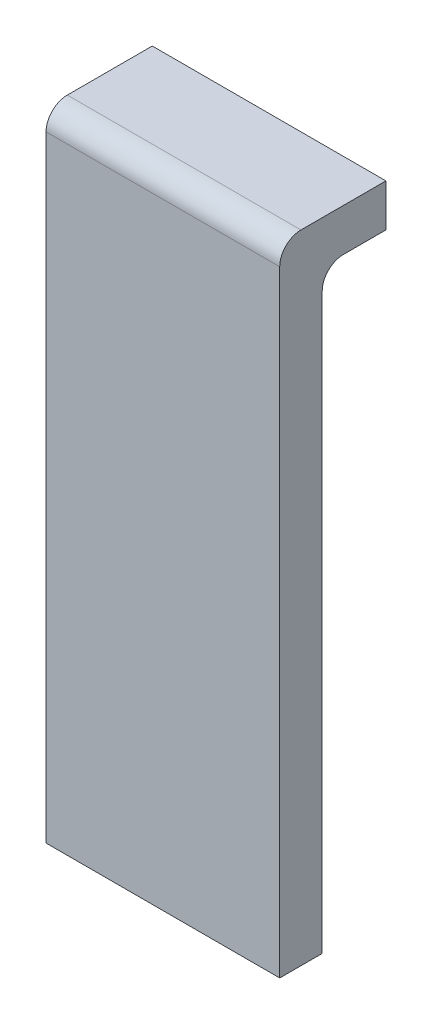
ISO-10303-21;
HEADER;
FILE_DESCRIPTION(('STEP AP214'),'2;1');
FILE_NAME('part.step','',(''),(''),'','','');
FILE_SCHEMA(('AUTOMOTIVE_DESIGN { 1 0 10303 214 1 1 1 1 }'));
ENDSEC;
DATA;
#1=APPLICATION_CONTEXT('core data for automotive mechanical design processes');
#2=APPLICATION_PROTOCOL_DEFINITION('international standard','automotive_design',2000,#1);
#3=PRODUCT_CONTEXT('',#1,'mechanical');
#4=PRODUCT('Part','Part','',(#3));
#5=PRODUCT_RELATED_PRODUCT_CATEGORY('part','',(#4));
#6=PRODUCT_DEFINITION_FORMATION('','',#4);
#7=PRODUCT_DEFINITION_CONTEXT('part definition',#1,'design');
#8=PRODUCT_DEFINITION('design','',#6,#7);
#9=PRODUCT_DEFINITION_SHAPE('','',#8);
#10=(LENGTH_UNIT() NAMED_UNIT(*) SI_UNIT(.MILLI.,.METRE.));
#11=(NAMED_UNIT(*) PLANE_ANGLE_UNIT() SI_UNIT($,.RADIAN.));
#12=(NAMED_UNIT(*) SI_UNIT($,.STERADIAN.) SOLID_ANGLE_UNIT());
#13=UNCERTAINTY_MEASURE_WITH_UNIT(LENGTH_MEASURE(1.E-05),#10,'distance_accuracy_value','');
#14=(GEOMETRIC_REPRESENTATION_CONTEXT(3) GLOBAL_UNCERTAINTY_ASSIGNED_CONTEXT((#13)) GLOBAL_UNIT_ASSIGNED_CONTEXT((#10,
#11,#12)) REPRESENTATION_CONTEXT('',''));
#15=CARTESIAN_POINT('',(0.,0.,0.));
#16=DIRECTION('',(0.,0.,1.));
#17=DIRECTION('',(1.,0.,0.));
#18=AXIS2_PLACEMENT_3D('',#15,#16,#17);
#19=CARTESIAN_POINT('',(0.,0.,-0.2));
#20=DIRECTION('',(-1.,0.,0.));
#21=DIRECTION('',(0.,0.,1.));
#22=AXIS2_PLACEMENT_3D('',#19,#20,#21);
#23=PLANE('',#22);
#24=DIRECTION('',(0.,-1.,0.));
#25=VECTOR('',#24,1.);
#26=CARTESIAN_POINT('',(0.,0.,0.));
#27=LINE('',#26,#25);
#28=CARTESIAN_POINT('',(0.,2.9,0.));
#29=VERTEX_POINT('',#28);
#30=CARTESIAN_POINT('',(0.,0.,0.));
#31=VERTEX_POINT('',#30);
#32=EDGE_CURVE('E119',#29,#31,#27,.T.);
#33=ORIENTED_EDGE('',*,*,#32,.F.);
#34=CARTESIAN_POINT('',(0.,2.9,-0.1));
#35=DIRECTION('',(-1.,0.,0.));
#36=DIRECTION('',(0.,0.,1.));
#37=AXIS2_PLACEMENT_3D('',#34,#35,#36);
#38=CIRCLE('',#37,0.1);
#39=CARTESIAN_POINT('',(0.,3.,-0.1));
#40=VERTEX_POINT('',#39);
#41=EDGE_CURVE('E132',#29,#40,#38,.T.);
#42=ORIENTED_EDGE('',*,*,#41,.T.);
#43=DIRECTION('',(0.,0.,1.));
#44=VECTOR('',#43,1.);
#45=CARTESIAN_POINT('',(0.,3.,-0.2));
#46=LINE('',#45,#44);
#47=CARTESIAN_POINT('',(0.,3.,-0.5));
#48=VERTEX_POINT('',#47);
#49=EDGE_CURVE('E133',#48,#40,#46,.T.);
#50=ORIENTED_EDGE('',*,*,#49,.F.);
#51=DIRECTION('',(0.,1.,0.));
#52=VECTOR('',#51,1.);
#53=CARTESIAN_POINT('',(0.,3.,-0.5));
#54=LINE('',#53,#52);
#55=CARTESIAN_POINT('',(0.,2.8,-0.5));
#56=VERTEX_POINT('',#55);
#57=EDGE_CURVE('E108',#56,#48,#54,.T.);
#58=ORIENTED_EDGE('',*,*,#57,.F.);
#59=DIRECTION('',(0.,0.,1.));
#60=VECTOR('',#59,1.);
#61=CARTESIAN_POINT('',(0.,2.8,-0.5));
#62=LINE('',#61,#60);
#63=CARTESIAN_POINT('',(0.,2.8,-0.3));
#64=VERTEX_POINT('',#63);
#65=EDGE_CURVE('E104',#56,#64,#62,.T.);
#66=ORIENTED_EDGE('',*,*,#65,.T.);
#67=CARTESIAN_POINT('',(0.,2.7,-0.3));
#68=DIRECTION('',(-1.,0.,0.));
#69=DIRECTION('',(0.,0.,1.));
#70=AXIS2_PLACEMENT_3D('',#67,#68,#69);
#71=CIRCLE('',#70,0.1);
#72=CARTESIAN_POINT('',(0.,2.7,-0.2));
#73=VERTEX_POINT('',#72);
#74=EDGE_CURVE('E40',#64,#73,#71,.F.);
#75=ORIENTED_EDGE('',*,*,#74,.T.);
#76=DIRECTION('',(0.,-1.,0.));
#77=VECTOR('',#76,1.);
#78=CARTESIAN_POINT('',(0.,0.,-0.2));
#79=LINE('',#78,#77);
#80=CARTESIAN_POINT('',(0.,0.,-0.2));
#81=VERTEX_POINT('',#80);
#82=EDGE_CURVE('E134',#73,#81,#79,.T.);
#83=ORIENTED_EDGE('',*,*,#82,.T.);
#84=DIRECTION('',(0.,0.,1.));
#85=VECTOR('',#84,1.);
#86=CARTESIAN_POINT('',(0.,0.,-0.2));
#87=LINE('',#86,#85);
#88=EDGE_CURVE('E151',#81,#31,#87,.T.);
#89=ORIENTED_EDGE('',*,*,#88,.T.);
#90=EDGE_LOOP('',(#33,#42,#50,#58,#66,#75,#83,#89));
#91=FACE_BOUND('',#90,.T.);
#92=ADVANCED_FACE('F32',(#91),#23,.T.);
#93=CARTESIAN_POINT('',(0.,3.,-0.2));
#94=DIRECTION('',(0.,1.,0.));
#95=DIRECTION('',(-1.,0.,0.));
#96=AXIS2_PLACEMENT_3D('',#93,#94,#95);
#97=PLANE('',#96);
#98=ORIENTED_EDGE('',*,*,#49,.T.);
#99=DIRECTION('',(-1.,0.,0.));
#100=VECTOR('',#99,1.);
#101=CARTESIAN_POINT('',(1.1,3.,-0.1));
#102=LINE('',#101,#100);
#103=CARTESIAN_POINT('',(1.1,3.,-0.1));
#104=VERTEX_POINT('',#103);
#105=EDGE_CURVE('E177',#40,#104,#102,.F.);
#106=ORIENTED_EDGE('',*,*,#105,.T.);
#107=DIRECTION('',(0.,0.,1.));
#108=VECTOR('',#107,1.);
#109=CARTESIAN_POINT('',(1.1,3.,-0.2));
#110=LINE('',#109,#108);
#111=CARTESIAN_POINT('',(1.1,3.,-0.5));
#112=VERTEX_POINT('',#111);
#113=EDGE_CURVE('E156',#112,#104,#110,.T.);
#114=ORIENTED_EDGE('',*,*,#113,.F.);
#115=DIRECTION('',(1.,0.,0.));
#116=VECTOR('',#115,1.);
#117=CARTESIAN_POINT('',(1.1,3.,-0.5));
#118=LINE('',#117,#116);
#119=EDGE_CURVE('E115',#48,#112,#118,.T.);
#120=ORIENTED_EDGE('',*,*,#119,.F.);
#121=EDGE_LOOP('',(#98,#106,#114,#120));
#122=FACE_BOUND('',#121,.T.);
#123=ADVANCED_FACE('F190',(#122),#97,.T.);
#124=CARTESIAN_POINT('',(1.1,0.,-0.2));
#125=DIRECTION('',(1.,0.,0.));
#126=DIRECTION('',(0.,0.,-1.));
#127=AXIS2_PLACEMENT_3D('',#124,#125,#126);
#128=PLANE('',#127);
#129=ORIENTED_EDGE('',*,*,#113,.T.);
#130=CARTESIAN_POINT('',(1.1,2.9,-0.1));
#131=DIRECTION('',(1.,0.,0.));
#132=DIRECTION('',(0.,0.,-1.));
#133=AXIS2_PLACEMENT_3D('',#130,#131,#132);
#134=CIRCLE('',#133,0.1);
#135=CARTESIAN_POINT('',(1.1,2.9,0.));
#136=VERTEX_POINT('',#135);
#137=EDGE_CURVE('E173',#104,#136,#134,.T.);
#138=ORIENTED_EDGE('',*,*,#137,.T.);
#139=DIRECTION('',(0.,1.,0.));
#140=VECTOR('',#139,1.);
#141=CARTESIAN_POINT('',(1.1,0.,0.));
#142=LINE('',#141,#140);
#143=CARTESIAN_POINT('',(1.1,0.,0.));
#144=VERTEX_POINT('',#143);
#145=EDGE_CURVE('E138',#144,#136,#142,.T.);
#146=ORIENTED_EDGE('',*,*,#145,.F.);
#147=DIRECTION('',(0.,0.,1.));
#148=VECTOR('',#147,1.);
#149=CARTESIAN_POINT('',(1.1,0.,-0.2));
#150=LINE('',#149,#148);
#151=CARTESIAN_POINT('',(1.1,0.,-0.2));
#152=VERTEX_POINT('',#151);
#153=EDGE_CURVE('E154',#152,#144,#150,.T.);
#154=ORIENTED_EDGE('',*,*,#153,.F.);
#155=DIRECTION('',(0.,1.,0.));
#156=VECTOR('',#155,1.);
#157=CARTESIAN_POINT('',(1.1,0.,-0.2));
#158=LINE('',#157,#156);
#159=CARTESIAN_POINT('',(1.1,2.7,-0.2));
#160=VERTEX_POINT('',#159);
#161=EDGE_CURVE('E146',#152,#160,#158,.T.);
#162=ORIENTED_EDGE('',*,*,#161,.T.);
#163=CARTESIAN_POINT('',(1.1,2.7,-0.3));
#164=DIRECTION('',(1.,0.,0.));
#165=DIRECTION('',(0.,0.,-1.));
#166=AXIS2_PLACEMENT_3D('',#163,#164,#165);
#167=CIRCLE('',#166,0.1);
#168=CARTESIAN_POINT('',(1.1,2.8,-0.3));
#169=VERTEX_POINT('',#168);
#170=EDGE_CURVE('E11',#160,#169,#167,.F.);
#171=ORIENTED_EDGE('',*,*,#170,.T.);
#172=DIRECTION('',(0.,0.,1.));
#173=VECTOR('',#172,1.);
#174=CARTESIAN_POINT('',(1.1,2.8,-0.5));
#175=LINE('',#174,#173);
#176=CARTESIAN_POINT('',(1.1,2.8,-0.5));
#177=VERTEX_POINT('',#176);
#178=EDGE_CURVE('E101',#177,#169,#175,.T.);
#179=ORIENTED_EDGE('',*,*,#178,.F.);
#180=DIRECTION('',(0.,-1.,0.));
#181=VECTOR('',#180,1.);
#182=CARTESIAN_POINT('',(1.1,3.,-0.5));
#183=LINE('',#182,#181);
#184=EDGE_CURVE('E109',#112,#177,#183,.T.);
#185=ORIENTED_EDGE('',*,*,#184,.F.);
#186=EDGE_LOOP('',(#129,#138,#146,#154,#162,#171,#179,#185));
#187=FACE_BOUND('',#186,.T.);
#188=ADVANCED_FACE('F118',(#187),#128,.T.);
#189=CARTESIAN_POINT('',(0.,0.,-0.2));
#190=DIRECTION('',(0.,-1.,0.));
#191=DIRECTION('',(0.,0.,-1.));
#192=AXIS2_PLACEMENT_3D('',#189,#190,#191);
#193=PLANE('',#192);
#194=DIRECTION('',(1.,0.,0.));
#195=VECTOR('',#194,1.);
#196=CARTESIAN_POINT('',(0.,0.,0.));
#197=LINE('',#196,#195);
#198=EDGE_CURVE('E121',#31,#144,#197,.T.);
#199=ORIENTED_EDGE('',*,*,#198,.F.);
#200=ORIENTED_EDGE('',*,*,#88,.F.);
#201=DIRECTION('',(1.,0.,0.));
#202=VECTOR('',#201,1.);
#203=CARTESIAN_POINT('',(0.,0.,-0.2));
#204=LINE('',#203,#202);
#205=EDGE_CURVE('E137',#81,#152,#204,.T.);
#206=ORIENTED_EDGE('',*,*,#205,.T.);
#207=ORIENTED_EDGE('',*,*,#153,.T.);
#208=EDGE_LOOP('',(#199,#200,#206,#207));
#209=FACE_BOUND('',#208,.T.);
#210=ADVANCED_FACE('F170',(#209),#193,.T.);
#211=CARTESIAN_POINT('',(0.,0.,-0.2));
#212=DIRECTION('',(0.,0.,-1.));
#213=DIRECTION('',(-1.,0.,0.));
#214=AXIS2_PLACEMENT_3D('',#211,#212,#213);
#215=PLANE('',#214);
#216=ORIENTED_EDGE('',*,*,#82,.F.);
#217=DIRECTION('',(-1.,0.,0.));
#218=VECTOR('',#217,1.);
#219=CARTESIAN_POINT('',(0.,2.7,-0.2));
#220=LINE('',#219,#218);
#221=EDGE_CURVE('E53',#73,#160,#220,.F.);
#222=ORIENTED_EDGE('',*,*,#221,.T.);
#223=ORIENTED_EDGE('',*,*,#161,.F.);
#224=ORIENTED_EDGE('',*,*,#205,.F.);
#225=EDGE_LOOP('',(#216,#222,#223,#224));
#226=FACE_BOUND('',#225,.T.);
#227=ADVANCED_FACE('F183',(#226),#215,.T.);
#228=CARTESIAN_POINT('',(0.,0.,0.));
#229=DIRECTION('',(0.,0.,-1.));
#230=DIRECTION('',(-1.,0.,0.));
#231=AXIS2_PLACEMENT_3D('',#228,#229,#230);
#232=PLANE('',#231);
#233=ORIENTED_EDGE('',*,*,#145,.T.);
#234=DIRECTION('',(-1.,0.,0.));
#235=VECTOR('',#234,1.);
#236=CARTESIAN_POINT('',(0.,2.9,0.));
#237=LINE('',#236,#235);
#238=EDGE_CURVE('E129',#136,#29,#237,.T.);
#239=ORIENTED_EDGE('',*,*,#238,.T.);
#240=ORIENTED_EDGE('',*,*,#32,.T.);
#241=ORIENTED_EDGE('',*,*,#198,.T.);
#242=EDGE_LOOP('',(#233,#239,#240,#241));
#243=FACE_BOUND('',#242,.T.);
#244=ADVANCED_FACE('F164',(#243),#232,.F.);
#245=CARTESIAN_POINT('',(1.1,2.8,-0.5));
#246=DIRECTION('',(0.,1.,0.));
#247=DIRECTION('',(0.,0.,1.));
#248=AXIS2_PLACEMENT_3D('',#245,#246,#247);
#249=PLANE('',#248);
#250=ORIENTED_EDGE('',*,*,#178,.T.);
#251=DIRECTION('',(-1.,0.,0.));
#252=VECTOR('',#251,1.);
#253=CARTESIAN_POINT('',(1.1,2.8,-0.3));
#254=LINE('',#253,#252);
#255=EDGE_CURVE('E176',#169,#64,#254,.T.);
#256=ORIENTED_EDGE('',*,*,#255,.T.);
#257=ORIENTED_EDGE('',*,*,#65,.F.);
#258=DIRECTION('',(-1.,0.,0.));
#259=VECTOR('',#258,1.);
#260=CARTESIAN_POINT('',(1.1,2.8,-0.5));
#261=LINE('',#260,#259);
#262=EDGE_CURVE('E97',#177,#56,#261,.T.);
#263=ORIENTED_EDGE('',*,*,#262,.F.);
#264=EDGE_LOOP('',(#250,#256,#257,#263));
#265=FACE_BOUND('',#264,.T.);
#266=ADVANCED_FACE('F99',(#265),#249,.F.);
#267=CARTESIAN_POINT('',(0.,0.,-0.5));
#268=DIRECTION('',(0.,0.,-1.));
#269=DIRECTION('',(-1.,0.,0.));
#270=AXIS2_PLACEMENT_3D('',#267,#268,#269);
#271=PLANE('',#270);
#272=ORIENTED_EDGE('',*,*,#184,.T.);
#273=ORIENTED_EDGE('',*,*,#262,.T.);
#274=ORIENTED_EDGE('',*,*,#57,.T.);
#275=ORIENTED_EDGE('',*,*,#119,.T.);
#276=EDGE_LOOP('',(#272,#273,#274,#275));
#277=FACE_BOUND('',#276,.T.);
#278=ADVANCED_FACE('F113',(#277),#271,.T.);
#279=CARTESIAN_POINT('',(0.,2.9,-0.1));
#280=DIRECTION('',(1.,0.,0.));
#281=DIRECTION('',(0.,1.,0.));
#282=AXIS2_PLACEMENT_3D('',#279,#280,#281);
#283=CYLINDRICAL_SURFACE('',#282,0.1);
#284=ORIENTED_EDGE('',*,*,#137,.F.);
#285=ORIENTED_EDGE('',*,*,#105,.F.);
#286=ORIENTED_EDGE('',*,*,#41,.F.);
#287=ORIENTED_EDGE('',*,*,#238,.F.);
#288=EDGE_LOOP('',(#284,#285,#286,#287));
#289=FACE_BOUND('',#288,.T.);
#290=ADVANCED_FACE('F185',(#289),#283,.T.);
#291=CARTESIAN_POINT('',(1.1,2.7,-0.3));
#292=DIRECTION('',(-1.,0.,0.));
#293=DIRECTION('',(0.,0.,1.));
#294=AXIS2_PLACEMENT_3D('',#291,#292,#293);
#295=CYLINDRICAL_SURFACE('',#294,0.1);
#296=ORIENTED_EDGE('',*,*,#170,.F.);
#297=ORIENTED_EDGE('',*,*,#221,.F.);
#298=ORIENTED_EDGE('',*,*,#74,.F.);
#299=ORIENTED_EDGE('',*,*,#255,.F.);
#300=EDGE_LOOP('',(#296,#297,#298,#299));
#301=FACE_BOUND('',#300,.T.);
#302=ADVANCED_FACE('F34',(#301),#295,.F.);
#303=CLOSED_SHELL('',(#92,#123,#188,#210,#227,#244,#266,#278,#290,#302));
#304=MANIFOLD_SOLID_BREP('B2',#303);
#305=ADVANCED_BREP_SHAPE_REPRESENTATION('',(#18,#304),#14);
#306=SHAPE_DEFINITION_REPRESENTATION(#9,#305);
ENDSEC;
END-ISO-10303-21;
